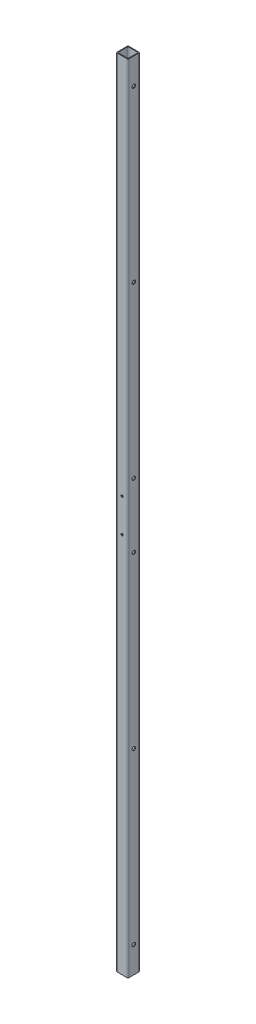
ISO-10303-21;
HEADER;
FILE_DESCRIPTION(('STEP AP214'),'2;1');
FILE_NAME('part.step','',(''),(''),'','','');
FILE_SCHEMA(('AUTOMOTIVE_DESIGN { 1 0 10303 214 1 1 1 1 }'));
ENDSEC;
DATA;
#1=APPLICATION_CONTEXT('core data for automotive mechanical design processes');
#2=APPLICATION_PROTOCOL_DEFINITION('international standard','automotive_design',2000,#1);
#3=PRODUCT_CONTEXT('',#1,'mechanical');
#4=PRODUCT('Part','Part','',(#3));
#5=PRODUCT_RELATED_PRODUCT_CATEGORY('part','',(#4));
#6=PRODUCT_DEFINITION_FORMATION('','',#4);
#7=PRODUCT_DEFINITION_CONTEXT('part definition',#1,'design');
#8=PRODUCT_DEFINITION('design','',#6,#7);
#9=PRODUCT_DEFINITION_SHAPE('','',#8);
#10=(LENGTH_UNIT() NAMED_UNIT(*) SI_UNIT(.MILLI.,.METRE.));
#11=(NAMED_UNIT(*) PLANE_ANGLE_UNIT() SI_UNIT($,.RADIAN.));
#12=(NAMED_UNIT(*) SI_UNIT($,.STERADIAN.) SOLID_ANGLE_UNIT());
#13=UNCERTAINTY_MEASURE_WITH_UNIT(LENGTH_MEASURE(1.E-05),#10,'distance_accuracy_value','');
#14=(GEOMETRIC_REPRESENTATION_CONTEXT(3) GLOBAL_UNCERTAINTY_ASSIGNED_CONTEXT((#13)) GLOBAL_UNIT_ASSIGNED_CONTEXT((#10,
#11,#12)) REPRESENTATION_CONTEXT('',''));
#15=CARTESIAN_POINT('',(0.,0.,0.));
#16=DIRECTION('',(0.,0.,1.));
#17=DIRECTION('',(1.,0.,0.));
#18=AXIS2_PLACEMENT_3D('',#15,#16,#17);
#19=CARTESIAN_POINT('',(0.,1309.624,0.));
#20=DIRECTION('',(0.,-1.,0.));
#21=DIRECTION('',(0.,0.,-1.));
#22=AXIS2_PLACEMENT_3D('',#19,#20,#21);
#23=PLANE('',#22);
#24=DIRECTION('',(0.,0.,1.));
#25=VECTOR('',#24,1.);
#26=CARTESIAN_POINT('',(-9.652,1309.624,9.652));
#27=LINE('',#26,#25);
#28=CARTESIAN_POINT('',(-9.652,1309.624,-8.382));
#29=VERTEX_POINT('',#28);
#30=CARTESIAN_POINT('',(-9.652,1309.624,8.382));
#31=VERTEX_POINT('',#30);
#32=EDGE_CURVE('E181',#29,#31,#27,.T.);
#33=ORIENTED_EDGE('',*,*,#32,.T.);
#34=CARTESIAN_POINT('',(-8.382,1309.624,8.382));
#35=DIRECTION('',(0.,-1.,0.));
#36=DIRECTION('',(0.,0.,-1.));
#37=AXIS2_PLACEMENT_3D('',#34,#35,#36);
#38=CIRCLE('',#37,1.27);
#39=CARTESIAN_POINT('',(-8.382,1309.624,9.652));
#40=VERTEX_POINT('',#39);
#41=EDGE_CURVE('E223',#31,#40,#38,.F.);
#42=ORIENTED_EDGE('',*,*,#41,.T.);
#43=DIRECTION('',(1.,0.,0.));
#44=VECTOR('',#43,1.);
#45=CARTESIAN_POINT('',(-9.652,1309.624,9.652));
#46=LINE('',#45,#44);
#47=CARTESIAN_POINT('',(8.382,1309.624,9.652));
#48=VERTEX_POINT('',#47);
#49=EDGE_CURVE('E176',#40,#48,#46,.T.);
#50=ORIENTED_EDGE('',*,*,#49,.T.);
#51=CARTESIAN_POINT('',(8.382,1309.624,8.382));
#52=DIRECTION('',(0.,-1.,0.));
#53=DIRECTION('',(0.,0.,-1.));
#54=AXIS2_PLACEMENT_3D('',#51,#52,#53);
#55=CIRCLE('',#54,1.27);
#56=CARTESIAN_POINT('',(9.652,1309.624,8.382));
#57=VERTEX_POINT('',#56);
#58=EDGE_CURVE('E218',#48,#57,#55,.F.);
#59=ORIENTED_EDGE('',*,*,#58,.T.);
#60=DIRECTION('',(0.,0.,-1.));
#61=VECTOR('',#60,1.);
#62=CARTESIAN_POINT('',(9.652,1309.624,9.652));
#63=LINE('',#62,#61);
#64=CARTESIAN_POINT('',(9.652,1309.624,-8.382));
#65=VERTEX_POINT('',#64);
#66=EDGE_CURVE('E350',#57,#65,#63,.T.);
#67=ORIENTED_EDGE('',*,*,#66,.T.);
#68=CARTESIAN_POINT('',(8.382,1309.624,-8.382));
#69=DIRECTION('',(0.,-1.,0.));
#70=DIRECTION('',(0.,0.,-1.));
#71=AXIS2_PLACEMENT_3D('',#68,#69,#70);
#72=CIRCLE('',#71,1.27);
#73=CARTESIAN_POINT('',(8.382,1309.624,-9.652));
#74=VERTEX_POINT('',#73);
#75=EDGE_CURVE('E59',#65,#74,#72,.F.);
#76=ORIENTED_EDGE('',*,*,#75,.T.);
#77=DIRECTION('',(-1.,0.,0.));
#78=VECTOR('',#77,1.);
#79=CARTESIAN_POINT('',(-9.652,1309.624,-9.652));
#80=LINE('',#79,#78);
#81=CARTESIAN_POINT('',(-8.382,1309.624,-9.652));
#82=VERTEX_POINT('',#81);
#83=EDGE_CURVE('E352',#74,#82,#80,.T.);
#84=ORIENTED_EDGE('',*,*,#83,.T.);
#85=CARTESIAN_POINT('',(-8.382,1309.624,-8.382));
#86=DIRECTION('',(0.,-1.,0.));
#87=DIRECTION('',(0.,0.,-1.));
#88=AXIS2_PLACEMENT_3D('',#85,#86,#87);
#89=CIRCLE('',#88,1.27);
#90=EDGE_CURVE('E221',#82,#29,#89,.F.);
#91=ORIENTED_EDGE('',*,*,#90,.T.);
#92=EDGE_LOOP('',(#33,#42,#50,#59,#67,#76,#84,#91));
#93=FACE_BOUND('',#92,.T.);
#94=DIRECTION('',(1.,0.,0.));
#95=VECTOR('',#94,1.);
#96=CARTESIAN_POINT('',(-8.382,1309.624,8.382));
#97=LINE('',#96,#95);
#98=CARTESIAN_POINT('',(-7.112,1309.624,8.382));
#99=VERTEX_POINT('',#98);
#100=CARTESIAN_POINT('',(7.112,1309.624,8.382));
#101=VERTEX_POINT('',#100);
#102=EDGE_CURVE('E333',#99,#101,#97,.T.);
#103=ORIENTED_EDGE('',*,*,#102,.F.);
#104=CARTESIAN_POINT('',(-7.112,1309.624,7.112));
#105=DIRECTION('',(0.,-1.,0.));
#106=DIRECTION('',(0.,0.,-1.));
#107=AXIS2_PLACEMENT_3D('',#104,#105,#106);
#108=CIRCLE('',#107,1.27);
#109=CARTESIAN_POINT('',(-8.382,1309.624,7.112));
#110=VERTEX_POINT('',#109);
#111=EDGE_CURVE('E11',#99,#110,#108,.T.);
#112=ORIENTED_EDGE('',*,*,#111,.T.);
#113=DIRECTION('',(0.,0.,1.));
#114=VECTOR('',#113,1.);
#115=CARTESIAN_POINT('',(-8.382,1309.624,8.382));
#116=LINE('',#115,#114);
#117=CARTESIAN_POINT('',(-8.382,1309.624,-7.11199999999999));
#118=VERTEX_POINT('',#117);
#119=EDGE_CURVE('E341',#118,#110,#116,.T.);
#120=ORIENTED_EDGE('',*,*,#119,.F.);
#121=CARTESIAN_POINT('',(-7.112,1309.624,-7.112));
#122=DIRECTION('',(0.,-1.,0.));
#123=DIRECTION('',(0.,0.,-1.));
#124=AXIS2_PLACEMENT_3D('',#121,#122,#123);
#125=CIRCLE('',#124,1.27);
#126=CARTESIAN_POINT('',(-7.112,1309.624,-8.382));
#127=VERTEX_POINT('',#126);
#128=EDGE_CURVE('E236',#118,#127,#125,.T.);
#129=ORIENTED_EDGE('',*,*,#128,.T.);
#130=DIRECTION('',(-1.,0.,0.));
#131=VECTOR('',#130,1.);
#132=CARTESIAN_POINT('',(-8.382,1309.624,-8.382));
#133=LINE('',#132,#131);
#134=CARTESIAN_POINT('',(7.112,1309.624,-8.382));
#135=VERTEX_POINT('',#134);
#136=EDGE_CURVE('E339',#135,#127,#133,.T.);
#137=ORIENTED_EDGE('',*,*,#136,.F.);
#138=CARTESIAN_POINT('',(7.112,1309.624,-7.112));
#139=DIRECTION('',(0.,-1.,0.));
#140=DIRECTION('',(0.,0.,-1.));
#141=AXIS2_PLACEMENT_3D('',#138,#139,#140);
#142=CIRCLE('',#141,1.27);
#143=CARTESIAN_POINT('',(8.382,1309.624,-7.11199999999999));
#144=VERTEX_POINT('',#143);
#145=EDGE_CURVE('E161',#135,#144,#142,.T.);
#146=ORIENTED_EDGE('',*,*,#145,.T.);
#147=DIRECTION('',(0.,0.,-1.));
#148=VECTOR('',#147,1.);
#149=CARTESIAN_POINT('',(8.382,1309.624,8.382));
#150=LINE('',#149,#148);
#151=CARTESIAN_POINT('',(8.382,1309.624,7.112));
#152=VERTEX_POINT('',#151);
#153=EDGE_CURVE('E336',#152,#144,#150,.T.);
#154=ORIENTED_EDGE('',*,*,#153,.F.);
#155=CARTESIAN_POINT('',(7.112,1309.624,7.112));
#156=DIRECTION('',(0.,-1.,0.));
#157=DIRECTION('',(0.,0.,-1.));
#158=AXIS2_PLACEMENT_3D('',#155,#156,#157);
#159=CIRCLE('',#158,1.27);
#160=EDGE_CURVE('E162',#152,#101,#159,.T.);
#161=ORIENTED_EDGE('',*,*,#160,.T.);
#162=EDGE_LOOP('',(#103,#112,#120,#129,#137,#146,#154,#161));
#163=FACE_BOUND('',#162,.T.);
#164=ADVANCED_FACE('F35',(#93,#163),#23,.F.);
#165=CARTESIAN_POINT('',(0.,0.,0.));
#166=DIRECTION('',(0.,-1.,0.));
#167=DIRECTION('',(0.,0.,-1.));
#168=AXIS2_PLACEMENT_3D('',#165,#166,#167);
#169=PLANE('',#168);
#170=DIRECTION('',(1.,0.,0.));
#171=VECTOR('',#170,1.);
#172=CARTESIAN_POINT('',(-9.652,0.,9.652));
#173=LINE('',#172,#171);
#174=CARTESIAN_POINT('',(-8.382,0.,9.652));
#175=VERTEX_POINT('',#174);
#176=CARTESIAN_POINT('',(8.382,0.,9.652));
#177=VERTEX_POINT('',#176);
#178=EDGE_CURVE('E184',#175,#177,#173,.T.);
#179=ORIENTED_EDGE('',*,*,#178,.F.);
#180=CARTESIAN_POINT('',(-8.382,0.,8.382));
#181=DIRECTION('',(0.,-1.,0.));
#182=DIRECTION('',(0.,0.,-1.));
#183=AXIS2_PLACEMENT_3D('',#180,#181,#182);
#184=CIRCLE('',#183,1.27);
#185=CARTESIAN_POINT('',(-9.652,0.,8.382));
#186=VERTEX_POINT('',#185);
#187=EDGE_CURVE('E211',#175,#186,#184,.T.);
#188=ORIENTED_EDGE('',*,*,#187,.T.);
#189=DIRECTION('',(0.,0.,1.));
#190=VECTOR('',#189,1.);
#191=CARTESIAN_POINT('',(-9.652,0.,9.652));
#192=LINE('',#191,#190);
#193=CARTESIAN_POINT('',(-9.652,0.,-8.382));
#194=VERTEX_POINT('',#193);
#195=EDGE_CURVE('E359',#194,#186,#192,.T.);
#196=ORIENTED_EDGE('',*,*,#195,.F.);
#197=CARTESIAN_POINT('',(-8.382,0.,-8.382));
#198=DIRECTION('',(0.,-1.,0.));
#199=DIRECTION('',(0.,0.,-1.));
#200=AXIS2_PLACEMENT_3D('',#197,#198,#199);
#201=CIRCLE('',#200,1.27);
#202=CARTESIAN_POINT('',(-8.382,0.,-9.652));
#203=VERTEX_POINT('',#202);
#204=EDGE_CURVE('E209',#194,#203,#201,.T.);
#205=ORIENTED_EDGE('',*,*,#204,.T.);
#206=DIRECTION('',(-1.,0.,0.));
#207=VECTOR('',#206,1.);
#208=CARTESIAN_POINT('',(-9.652,0.,-9.652));
#209=LINE('',#208,#207);
#210=CARTESIAN_POINT('',(8.382,0.,-9.652));
#211=VERTEX_POINT('',#210);
#212=EDGE_CURVE('E358',#211,#203,#209,.T.);
#213=ORIENTED_EDGE('',*,*,#212,.F.);
#214=CARTESIAN_POINT('',(8.382,0.,-8.382));
#215=DIRECTION('',(0.,-1.,0.));
#216=DIRECTION('',(0.,0.,-1.));
#217=AXIS2_PLACEMENT_3D('',#214,#215,#216);
#218=CIRCLE('',#217,1.27);
#219=CARTESIAN_POINT('',(9.652,0.,-8.382));
#220=VERTEX_POINT('',#219);
#221=EDGE_CURVE('E207',#211,#220,#218,.T.);
#222=ORIENTED_EDGE('',*,*,#221,.T.);
#223=DIRECTION('',(0.,0.,-1.));
#224=VECTOR('',#223,1.);
#225=CARTESIAN_POINT('',(9.652,0.,9.652));
#226=LINE('',#225,#224);
#227=CARTESIAN_POINT('',(9.652,0.,8.382));
#228=VERTEX_POINT('',#227);
#229=EDGE_CURVE('E344',#228,#220,#226,.T.);
#230=ORIENTED_EDGE('',*,*,#229,.F.);
#231=CARTESIAN_POINT('',(8.382,0.,8.382));
#232=DIRECTION('',(0.,-1.,0.));
#233=DIRECTION('',(0.,0.,-1.));
#234=AXIS2_PLACEMENT_3D('',#231,#232,#233);
#235=CIRCLE('',#234,1.27);
#236=EDGE_CURVE('E205',#228,#177,#235,.T.);
#237=ORIENTED_EDGE('',*,*,#236,.T.);
#238=EDGE_LOOP('',(#179,#188,#196,#205,#213,#222,#230,#237));
#239=FACE_BOUND('',#238,.T.);
#240=DIRECTION('',(-1.,0.,0.));
#241=VECTOR('',#240,1.);
#242=CARTESIAN_POINT('',(-8.382,0.,-8.382));
#243=LINE('',#242,#241);
#244=CARTESIAN_POINT('',(7.112,0.,-8.382));
#245=VERTEX_POINT('',#244);
#246=CARTESIAN_POINT('',(-7.112,0.,-8.382));
#247=VERTEX_POINT('',#246);
#248=EDGE_CURVE('E154',#245,#247,#243,.T.);
#249=ORIENTED_EDGE('',*,*,#248,.T.);
#250=CARTESIAN_POINT('',(-7.112,0.,-7.112));
#251=DIRECTION('',(0.,-1.,0.));
#252=DIRECTION('',(0.,0.,-1.));
#253=AXIS2_PLACEMENT_3D('',#250,#251,#252);
#254=CIRCLE('',#253,1.27);
#255=CARTESIAN_POINT('',(-8.382,0.,-7.11199999999999));
#256=VERTEX_POINT('',#255);
#257=EDGE_CURVE('E234',#247,#256,#254,.F.);
#258=ORIENTED_EDGE('',*,*,#257,.T.);
#259=DIRECTION('',(0.,0.,1.));
#260=VECTOR('',#259,1.);
#261=CARTESIAN_POINT('',(-8.382,0.,8.382));
#262=LINE('',#261,#260);
#263=CARTESIAN_POINT('',(-8.382,0.,7.112));
#264=VERTEX_POINT('',#263);
#265=EDGE_CURVE('E172',#256,#264,#262,.T.);
#266=ORIENTED_EDGE('',*,*,#265,.T.);
#267=CARTESIAN_POINT('',(-7.112,0.,7.112));
#268=DIRECTION('',(0.,-1.,0.));
#269=DIRECTION('',(0.,0.,-1.));
#270=AXIS2_PLACEMENT_3D('',#267,#268,#269);
#271=CIRCLE('',#270,1.27);
#272=CARTESIAN_POINT('',(-7.112,0.,8.382));
#273=VERTEX_POINT('',#272);
#274=EDGE_CURVE('E44',#264,#273,#271,.F.);
#275=ORIENTED_EDGE('',*,*,#274,.T.);
#276=DIRECTION('',(1.,0.,0.));
#277=VECTOR('',#276,1.);
#278=CARTESIAN_POINT('',(-8.382,0.,8.382));
#279=LINE('',#278,#277);
#280=CARTESIAN_POINT('',(7.112,0.,8.382));
#281=VERTEX_POINT('',#280);
#282=EDGE_CURVE('E332',#273,#281,#279,.T.);
#283=ORIENTED_EDGE('',*,*,#282,.T.);
#284=CARTESIAN_POINT('',(7.112,0.,7.112));
#285=DIRECTION('',(0.,-1.,0.));
#286=DIRECTION('',(0.,0.,-1.));
#287=AXIS2_PLACEMENT_3D('',#284,#285,#286);
#288=CIRCLE('',#287,1.27);
#289=CARTESIAN_POINT('',(8.382,0.,7.112));
#290=VERTEX_POINT('',#289);
#291=EDGE_CURVE('E238',#281,#290,#288,.F.);
#292=ORIENTED_EDGE('',*,*,#291,.T.);
#293=DIRECTION('',(0.,0.,-1.));
#294=VECTOR('',#293,1.);
#295=CARTESIAN_POINT('',(8.382,0.,8.382));
#296=LINE('',#295,#294);
#297=CARTESIAN_POINT('',(8.382,0.,-7.11199999999999));
#298=VERTEX_POINT('',#297);
#299=EDGE_CURVE('E156',#290,#298,#296,.T.);
#300=ORIENTED_EDGE('',*,*,#299,.T.);
#301=CARTESIAN_POINT('',(7.112,0.,-7.112));
#302=DIRECTION('',(0.,-1.,0.));
#303=DIRECTION('',(0.,0.,-1.));
#304=AXIS2_PLACEMENT_3D('',#301,#302,#303);
#305=CIRCLE('',#304,1.27);
#306=EDGE_CURVE('E151',#298,#245,#305,.F.);
#307=ORIENTED_EDGE('',*,*,#306,.T.);
#308=EDGE_LOOP('',(#249,#258,#266,#275,#283,#292,#300,#307));
#309=FACE_BOUND('',#308,.T.);
#310=ADVANCED_FACE('F153',(#239,#309),#169,.T.);
#311=CARTESIAN_POINT('',(9.652,1309.624,9.652));
#312=DIRECTION('',(-1.,0.,0.));
#313=DIRECTION('',(0.,0.,1.));
#314=AXIS2_PLACEMENT_3D('',#311,#312,#313);
#315=PLANE('',#314);
#316=CARTESIAN_POINT('',(9.652,1266.444,0.));
#317=DIRECTION('',(1.,0.,0.));
#318=DIRECTION('',(0.,0.,-1.));
#319=AXIS2_PLACEMENT_3D('',#316,#317,#318);
#320=CIRCLE('',#319,2.8956);
#321=CARTESIAN_POINT('',(9.652,1266.444,-2.89559999999992));
#322=VERTEX_POINT('',#321);
#323=EDGE_CURVE('E274',#322,#322,#320,.T.);
#324=ORIENTED_EDGE('',*,*,#323,.F.);
#325=EDGE_LOOP('',(#324));
#326=FACE_BOUND('',#325,.T.);
#327=CARTESIAN_POINT('',(9.652,987.044,0.));
#328=DIRECTION('',(1.,0.,0.));
#329=DIRECTION('',(0.,0.,-1.));
#330=AXIS2_PLACEMENT_3D('',#327,#328,#329);
#331=CIRCLE('',#330,2.8956);
#332=CARTESIAN_POINT('',(9.652,987.044,-2.89559999999992));
#333=VERTEX_POINT('',#332);
#334=EDGE_CURVE('E292',#333,#333,#331,.T.);
#335=ORIENTED_EDGE('',*,*,#334,.F.);
#336=EDGE_LOOP('',(#335));
#337=FACE_BOUND('',#336,.T.);
#338=CARTESIAN_POINT('',(9.652,707.644,0.));
#339=DIRECTION('',(1.,0.,0.));
#340=DIRECTION('',(0.,0.,-1.));
#341=AXIS2_PLACEMENT_3D('',#338,#339,#340);
#342=CIRCLE('',#341,2.8956);
#343=CARTESIAN_POINT('',(9.652,707.644,-2.89559999999992));
#344=VERTEX_POINT('',#343);
#345=EDGE_CURVE('E299',#344,#344,#342,.T.);
#346=ORIENTED_EDGE('',*,*,#345,.F.);
#347=EDGE_LOOP('',(#346));
#348=FACE_BOUND('',#347,.T.);
#349=CARTESIAN_POINT('',(9.652,43.18,-1.54390389361936E-13));
#350=DIRECTION('',(1.,0.,0.));
#351=DIRECTION('',(0.,0.,-1.));
#352=AXIS2_PLACEMENT_3D('',#349,#350,#351);
#353=CIRCLE('',#352,2.89559999999998);
#354=CARTESIAN_POINT('',(9.652,43.18,-2.89560000000014));
#355=VERTEX_POINT('',#354);
#356=EDGE_CURVE('E306',#355,#355,#353,.T.);
#357=ORIENTED_EDGE('',*,*,#356,.F.);
#358=EDGE_LOOP('',(#357));
#359=FACE_BOUND('',#358,.T.);
#360=CARTESIAN_POINT('',(9.652,322.58,-1.54390389361936E-13));
#361=DIRECTION('',(1.,0.,0.));
#362=DIRECTION('',(0.,0.,-1.));
#363=AXIS2_PLACEMENT_3D('',#360,#361,#362);
#364=CIRCLE('',#363,2.8956);
#365=CARTESIAN_POINT('',(9.652,322.58,-2.89560000000015));
#366=VERTEX_POINT('',#365);
#367=EDGE_CURVE('E313',#366,#366,#364,.T.);
#368=ORIENTED_EDGE('',*,*,#367,.F.);
#369=EDGE_LOOP('',(#368));
#370=FACE_BOUND('',#369,.T.);
#371=CARTESIAN_POINT('',(9.652,601.98,-1.54390389361936E-13));
#372=DIRECTION('',(1.,0.,0.));
#373=DIRECTION('',(0.,0.,-1.));
#374=AXIS2_PLACEMENT_3D('',#371,#372,#373);
#375=CIRCLE('',#374,2.8956);
#376=CARTESIAN_POINT('',(9.652,601.98,-2.89560000000015));
#377=VERTEX_POINT('',#376);
#378=EDGE_CURVE('E320',#377,#377,#375,.T.);
#379=ORIENTED_EDGE('',*,*,#378,.F.);
#380=EDGE_LOOP('',(#379));
#381=FACE_BOUND('',#380,.T.);
#382=ORIENTED_EDGE('',*,*,#229,.T.);
#383=DIRECTION('',(0.,-1.,0.));
#384=VECTOR('',#383,1.);
#385=CARTESIAN_POINT('',(9.652,1309.624,-8.382));
#386=LINE('',#385,#384);
#387=EDGE_CURVE('E232',#220,#65,#386,.F.);
#388=ORIENTED_EDGE('',*,*,#387,.T.);
#389=ORIENTED_EDGE('',*,*,#66,.F.);
#390=DIRECTION('',(0.,-1.,0.));
#391=VECTOR('',#390,1.);
#392=CARTESIAN_POINT('',(9.652,1309.624,8.382));
#393=LINE('',#392,#391);
#394=EDGE_CURVE('E229',#57,#228,#393,.T.);
#395=ORIENTED_EDGE('',*,*,#394,.T.);
#396=EDGE_LOOP('',(#382,#388,#389,#395));
#397=FACE_BOUND('',#396,.T.);
#398=ADVANCED_FACE('F378',(#326,#337,#348,#359,#370,#381,#397),#315,.F.);
#399=CARTESIAN_POINT('',(-9.652,1309.624,-9.652));
#400=DIRECTION('',(0.,0.,1.));
#401=DIRECTION('',(1.,0.,0.));
#402=AXIS2_PLACEMENT_3D('',#399,#400,#401);
#403=PLANE('',#402);
#404=CARTESIAN_POINT('',(0.,682.244,-9.652));
#405=DIRECTION('',(0.,0.,-1.));
#406=DIRECTION('',(-1.,0.,0.));
#407=AXIS2_PLACEMENT_3D('',#404,#405,#406);
#408=CIRCLE('',#407,1.72719999999999);
#409=CARTESIAN_POINT('',(-1.72719999999999,682.244,-9.652));
#410=VERTEX_POINT('',#409);
#411=EDGE_CURVE('E817',#410,#410,#408,.T.);
#412=ORIENTED_EDGE('',*,*,#411,.F.);
#413=EDGE_LOOP('',(#412));
#414=FACE_BOUND('',#413,.T.);
#415=CARTESIAN_POINT('',(0.,627.38,-9.652));
#416=DIRECTION('',(0.,0.,-1.));
#417=DIRECTION('',(-1.,0.,0.));
#418=AXIS2_PLACEMENT_3D('',#415,#416,#417);
#419=CIRCLE('',#418,1.72719999999999);
#420=CARTESIAN_POINT('',(-1.72719999999999,627.38,-9.652));
#421=VERTEX_POINT('',#420);
#422=EDGE_CURVE('E277',#421,#421,#419,.T.);
#423=ORIENTED_EDGE('',*,*,#422,.F.);
#424=EDGE_LOOP('',(#423));
#425=FACE_BOUND('',#424,.T.);
#426=ORIENTED_EDGE('',*,*,#212,.T.);
#427=DIRECTION('',(0.,-1.,0.));
#428=VECTOR('',#427,1.);
#429=CARTESIAN_POINT('',(-8.382,1309.624,-9.652));
#430=LINE('',#429,#428);
#431=EDGE_CURVE('E52',#203,#82,#430,.F.);
#432=ORIENTED_EDGE('',*,*,#431,.T.);
#433=ORIENTED_EDGE('',*,*,#83,.F.);
#434=DIRECTION('',(0.,-1.,0.));
#435=VECTOR('',#434,1.);
#436=CARTESIAN_POINT('',(8.382,1309.624,-9.652));
#437=LINE('',#436,#435);
#438=EDGE_CURVE('E225',#74,#211,#437,.T.);
#439=ORIENTED_EDGE('',*,*,#438,.T.);
#440=EDGE_LOOP('',(#426,#432,#433,#439));
#441=FACE_BOUND('',#440,.T.);
#442=ADVANCED_FACE('F385',(#414,#425,#441),#403,.F.);
#443=CARTESIAN_POINT('',(-9.652,1309.624,9.652));
#444=DIRECTION('',(1.,0.,0.));
#445=DIRECTION('',(0.,0.,-1.));
#446=AXIS2_PLACEMENT_3D('',#443,#444,#445);
#447=PLANE('',#446);
#448=CARTESIAN_POINT('',(-9.652,1266.444,0.));
#449=DIRECTION('',(1.,0.,0.));
#450=DIRECTION('',(0.,0.,-1.));
#451=AXIS2_PLACEMENT_3D('',#448,#449,#450);
#452=CIRCLE('',#451,2.8956);
#453=CARTESIAN_POINT('',(-9.652,1266.444,-2.89559999999992));
#454=VERTEX_POINT('',#453);
#455=EDGE_CURVE('E266',#454,#454,#452,.T.);
#456=ORIENTED_EDGE('',*,*,#455,.T.);
#457=EDGE_LOOP('',(#456));
#458=FACE_BOUND('',#457,.T.);
#459=CARTESIAN_POINT('',(-9.652,987.044,0.));
#460=DIRECTION('',(1.,0.,0.));
#461=DIRECTION('',(0.,0.,-1.));
#462=AXIS2_PLACEMENT_3D('',#459,#460,#461);
#463=CIRCLE('',#462,2.8956);
#464=CARTESIAN_POINT('',(-9.652,987.044,-2.89559999999992));
#465=VERTEX_POINT('',#464);
#466=EDGE_CURVE('E262',#465,#465,#463,.T.);
#467=ORIENTED_EDGE('',*,*,#466,.T.);
#468=EDGE_LOOP('',(#467));
#469=FACE_BOUND('',#468,.T.);
#470=CARTESIAN_POINT('',(-9.652,707.644,0.));
#471=DIRECTION('',(1.,0.,0.));
#472=DIRECTION('',(0.,0.,-1.));
#473=AXIS2_PLACEMENT_3D('',#470,#471,#472);
#474=CIRCLE('',#473,2.8956);
#475=CARTESIAN_POINT('',(-9.652,707.644,-2.89559999999992));
#476=VERTEX_POINT('',#475);
#477=EDGE_CURVE('E257',#476,#476,#474,.T.);
#478=ORIENTED_EDGE('',*,*,#477,.T.);
#479=EDGE_LOOP('',(#478));
#480=FACE_BOUND('',#479,.T.);
#481=CARTESIAN_POINT('',(-9.652,43.18,-1.54390389361936E-13));
#482=DIRECTION('',(1.,0.,0.));
#483=DIRECTION('',(0.,0.,-1.));
#484=AXIS2_PLACEMENT_3D('',#481,#482,#483);
#485=CIRCLE('',#484,2.89559999999998);
#486=CARTESIAN_POINT('',(-9.652,43.18,-2.89560000000014));
#487=VERTEX_POINT('',#486);
#488=EDGE_CURVE('E252',#487,#487,#485,.T.);
#489=ORIENTED_EDGE('',*,*,#488,.T.);
#490=EDGE_LOOP('',(#489));
#491=FACE_BOUND('',#490,.T.);
#492=CARTESIAN_POINT('',(-9.652,322.58,-1.54390389361936E-13));
#493=DIRECTION('',(1.,0.,0.));
#494=DIRECTION('',(0.,0.,-1.));
#495=AXIS2_PLACEMENT_3D('',#492,#493,#494);
#496=CIRCLE('',#495,2.8956);
#497=CARTESIAN_POINT('',(-9.652,322.58,-2.89560000000015));
#498=VERTEX_POINT('',#497);
#499=EDGE_CURVE('E247',#498,#498,#496,.T.);
#500=ORIENTED_EDGE('',*,*,#499,.T.);
#501=EDGE_LOOP('',(#500));
#502=FACE_BOUND('',#501,.T.);
#503=CARTESIAN_POINT('',(-9.652,601.98,-1.54390389361936E-13));
#504=DIRECTION('',(1.,0.,0.));
#505=DIRECTION('',(0.,0.,-1.));
#506=AXIS2_PLACEMENT_3D('',#503,#504,#505);
#507=CIRCLE('',#506,2.8956);
#508=CARTESIAN_POINT('',(-9.652,601.98,-2.89560000000015));
#509=VERTEX_POINT('',#508);
#510=EDGE_CURVE('E323',#509,#509,#507,.T.);
#511=ORIENTED_EDGE('',*,*,#510,.T.);
#512=EDGE_LOOP('',(#511));
#513=FACE_BOUND('',#512,.T.);
#514=ORIENTED_EDGE('',*,*,#195,.T.);
#515=DIRECTION('',(0.,-1.,0.));
#516=VECTOR('',#515,1.);
#517=CARTESIAN_POINT('',(-9.652,1309.624,8.382));
#518=LINE('',#517,#516);
#519=EDGE_CURVE('E216',#186,#31,#518,.F.);
#520=ORIENTED_EDGE('',*,*,#519,.T.);
#521=ORIENTED_EDGE('',*,*,#32,.F.);
#522=DIRECTION('',(0.,-1.,0.));
#523=VECTOR('',#522,1.);
#524=CARTESIAN_POINT('',(-9.652,1309.624,-8.382));
#525=LINE('',#524,#523);
#526=EDGE_CURVE('E213',#29,#194,#525,.T.);
#527=ORIENTED_EDGE('',*,*,#526,.T.);
#528=EDGE_LOOP('',(#514,#520,#521,#527));
#529=FACE_BOUND('',#528,.T.);
#530=ADVANCED_FACE('F391',(#458,#469,#480,#491,#502,#513,#529),#447,.F.);
#531=CARTESIAN_POINT('',(-9.652,1309.624,9.652));
#532=DIRECTION('',(0.,0.,-1.));
#533=DIRECTION('',(-1.,0.,0.));
#534=AXIS2_PLACEMENT_3D('',#531,#532,#533);
#535=PLANE('',#534);
#536=CARTESIAN_POINT('',(0.,682.244,9.652));
#537=DIRECTION('',(0.,0.,-1.));
#538=DIRECTION('',(-1.,0.,0.));
#539=AXIS2_PLACEMENT_3D('',#536,#537,#538);
#540=CIRCLE('',#539,1.72719999999999);
#541=CARTESIAN_POINT('',(-1.72719999999999,682.244,9.652));
#542=VERTEX_POINT('',#541);
#543=EDGE_CURVE('E813',#542,#542,#540,.T.);
#544=ORIENTED_EDGE('',*,*,#543,.T.);
#545=EDGE_LOOP('',(#544));
#546=FACE_BOUND('',#545,.T.);
#547=CARTESIAN_POINT('',(0.,627.38,9.652));
#548=DIRECTION('',(0.,0.,-1.));
#549=DIRECTION('',(-1.,0.,0.));
#550=AXIS2_PLACEMENT_3D('',#547,#548,#549);
#551=CIRCLE('',#550,1.72719999999999);
#552=CARTESIAN_POINT('',(-1.72719999999999,627.38,9.652));
#553=VERTEX_POINT('',#552);
#554=EDGE_CURVE('E270',#553,#553,#551,.T.);
#555=ORIENTED_EDGE('',*,*,#554,.T.);
#556=EDGE_LOOP('',(#555));
#557=FACE_BOUND('',#556,.T.);
#558=ORIENTED_EDGE('',*,*,#49,.F.);
#559=DIRECTION('',(0.,-1.,0.));
#560=VECTOR('',#559,1.);
#561=CARTESIAN_POINT('',(-8.382,1309.624,9.652));
#562=LINE('',#561,#560);
#563=EDGE_CURVE('E202',#40,#175,#562,.T.);
#564=ORIENTED_EDGE('',*,*,#563,.T.);
#565=ORIENTED_EDGE('',*,*,#178,.T.);
#566=DIRECTION('',(0.,-1.,0.));
#567=VECTOR('',#566,1.);
#568=CARTESIAN_POINT('',(8.382,1309.624,9.652));
#569=LINE('',#568,#567);
#570=EDGE_CURVE('E200',#177,#48,#569,.F.);
#571=ORIENTED_EDGE('',*,*,#570,.T.);
#572=EDGE_LOOP('',(#558,#564,#565,#571));
#573=FACE_BOUND('',#572,.T.);
#574=ADVANCED_FACE('F369',(#546,#557,#573),#535,.F.);
#575=CARTESIAN_POINT('',(-8.382,1309.624,8.382));
#576=DIRECTION('',(0.,0.,-1.));
#577=DIRECTION('',(-1.,0.,0.));
#578=AXIS2_PLACEMENT_3D('',#575,#576,#577);
#579=PLANE('',#578);
#580=CARTESIAN_POINT('',(0.,682.244,8.382));
#581=DIRECTION('',(0.,0.,-1.));
#582=DIRECTION('',(-1.,0.,0.));
#583=AXIS2_PLACEMENT_3D('',#580,#581,#582);
#584=CIRCLE('',#583,1.72719999999999);
#585=CARTESIAN_POINT('',(-1.72719999999999,682.244,8.382));
#586=VERTEX_POINT('',#585);
#587=EDGE_CURVE('E282',#586,#586,#584,.T.);
#588=ORIENTED_EDGE('',*,*,#587,.F.);
#589=EDGE_LOOP('',(#588));
#590=FACE_BOUND('',#589,.T.);
#591=CARTESIAN_POINT('',(0.,627.38,8.382));
#592=DIRECTION('',(0.,0.,-1.));
#593=DIRECTION('',(-1.,0.,0.));
#594=AXIS2_PLACEMENT_3D('',#591,#592,#593);
#595=CIRCLE('',#594,1.72719999999999);
#596=CARTESIAN_POINT('',(-1.72719999999999,627.38,8.382));
#597=VERTEX_POINT('',#596);
#598=EDGE_CURVE('E269',#597,#597,#595,.T.);
#599=ORIENTED_EDGE('',*,*,#598,.F.);
#600=EDGE_LOOP('',(#599));
#601=FACE_BOUND('',#600,.T.);
#602=ORIENTED_EDGE('',*,*,#102,.T.);
#603=DIRECTION('',(0.,-1.,0.));
#604=VECTOR('',#603,1.);
#605=CARTESIAN_POINT('',(7.112,0.,8.382));
#606=LINE('',#605,#604);
#607=EDGE_CURVE('E193',#101,#281,#606,.T.);
#608=ORIENTED_EDGE('',*,*,#607,.T.);
#609=ORIENTED_EDGE('',*,*,#282,.F.);
#610=DIRECTION('',(0.,-1.,0.));
#611=VECTOR('',#610,1.);
#612=CARTESIAN_POINT('',(-7.112,1309.624,8.382));
#613=LINE('',#612,#611);
#614=EDGE_CURVE('E191',#273,#99,#613,.F.);
#615=ORIENTED_EDGE('',*,*,#614,.T.);
#616=EDGE_LOOP('',(#602,#608,#609,#615));
#617=FACE_BOUND('',#616,.T.);
#618=ADVANCED_FACE('F412',(#590,#601,#617),#579,.T.);
#619=CARTESIAN_POINT('',(8.382,1309.624,8.382));
#620=DIRECTION('',(-1.,0.,0.));
#621=DIRECTION('',(0.,0.,1.));
#622=AXIS2_PLACEMENT_3D('',#619,#620,#621);
#623=PLANE('',#622);
#624=CARTESIAN_POINT('',(8.382,1266.444,0.));
#625=DIRECTION('',(-1.,0.,0.));
#626=DIRECTION('',(0.,0.,1.));
#627=AXIS2_PLACEMENT_3D('',#624,#625,#626);
#628=CIRCLE('',#627,2.8956);
#629=CARTESIAN_POINT('',(8.382,1266.444,2.89560000000007));
#630=VERTEX_POINT('',#629);
#631=EDGE_CURVE('E265',#630,#630,#628,.T.);
#632=ORIENTED_EDGE('',*,*,#631,.F.);
#633=EDGE_LOOP('',(#632));
#634=FACE_BOUND('',#633,.T.);
#635=CARTESIAN_POINT('',(8.382,987.044,0.));
#636=DIRECTION('',(-1.,0.,0.));
#637=DIRECTION('',(0.,0.,1.));
#638=AXIS2_PLACEMENT_3D('',#635,#636,#637);
#639=CIRCLE('',#638,2.8956);
#640=CARTESIAN_POINT('',(8.382,987.044,2.89560000000007));
#641=VERTEX_POINT('',#640);
#642=EDGE_CURVE('E261',#641,#641,#639,.T.);
#643=ORIENTED_EDGE('',*,*,#642,.F.);
#644=EDGE_LOOP('',(#643));
#645=FACE_BOUND('',#644,.T.);
#646=CARTESIAN_POINT('',(8.382,707.644,0.));
#647=DIRECTION('',(-1.,0.,0.));
#648=DIRECTION('',(0.,0.,1.));
#649=AXIS2_PLACEMENT_3D('',#646,#647,#648);
#650=CIRCLE('',#649,2.8956);
#651=CARTESIAN_POINT('',(8.382,707.644,2.89560000000007));
#652=VERTEX_POINT('',#651);
#653=EDGE_CURVE('E256',#652,#652,#650,.T.);
#654=ORIENTED_EDGE('',*,*,#653,.F.);
#655=EDGE_LOOP('',(#654));
#656=FACE_BOUND('',#655,.T.);
#657=CARTESIAN_POINT('',(8.382,43.18,-1.54390389361936E-13));
#658=DIRECTION('',(-1.,0.,0.));
#659=DIRECTION('',(0.,0.,1.));
#660=AXIS2_PLACEMENT_3D('',#657,#658,#659);
#661=CIRCLE('',#660,2.89559999999998);
#662=CARTESIAN_POINT('',(8.382,43.18,2.89559999999983));
#663=VERTEX_POINT('',#662);
#664=EDGE_CURVE('E251',#663,#663,#661,.T.);
#665=ORIENTED_EDGE('',*,*,#664,.F.);
#666=EDGE_LOOP('',(#665));
#667=FACE_BOUND('',#666,.T.);
#668=CARTESIAN_POINT('',(8.382,322.58,-1.54390389361936E-13));
#669=DIRECTION('',(-1.,0.,0.));
#670=DIRECTION('',(0.,0.,1.));
#671=AXIS2_PLACEMENT_3D('',#668,#669,#670);
#672=CIRCLE('',#671,2.8956);
#673=CARTESIAN_POINT('',(8.382,322.58,2.89559999999984));
#674=VERTEX_POINT('',#673);
#675=EDGE_CURVE('E246',#674,#674,#672,.T.);
#676=ORIENTED_EDGE('',*,*,#675,.F.);
#677=EDGE_LOOP('',(#676));
#678=FACE_BOUND('',#677,.T.);
#679=CARTESIAN_POINT('',(8.382,601.98,-1.54390389361936E-13));
#680=DIRECTION('',(-1.,0.,0.));
#681=DIRECTION('',(0.,0.,1.));
#682=AXIS2_PLACEMENT_3D('',#679,#680,#681);
#683=CIRCLE('',#682,2.8956);
#684=CARTESIAN_POINT('',(8.382,601.98,2.89559999999984));
#685=VERTEX_POINT('',#684);
#686=EDGE_CURVE('E329',#685,#685,#683,.T.);
#687=ORIENTED_EDGE('',*,*,#686,.F.);
#688=EDGE_LOOP('',(#687));
#689=FACE_BOUND('',#688,.T.);
#690=ORIENTED_EDGE('',*,*,#299,.F.);
#691=DIRECTION('',(0.,-1.,0.));
#692=VECTOR('',#691,1.);
#693=CARTESIAN_POINT('',(8.382,1309.624,7.112));
#694=LINE('',#693,#692);
#695=EDGE_CURVE('E198',#290,#152,#694,.F.);
#696=ORIENTED_EDGE('',*,*,#695,.T.);
#697=ORIENTED_EDGE('',*,*,#153,.T.);
#698=DIRECTION('',(0.,-1.,0.));
#699=VECTOR('',#698,1.);
#700=CARTESIAN_POINT('',(8.382,0.,-7.112));
#701=LINE('',#700,#699);
#702=EDGE_CURVE('E196',#144,#298,#701,.T.);
#703=ORIENTED_EDGE('',*,*,#702,.T.);
#704=EDGE_LOOP('',(#690,#696,#697,#703));
#705=FACE_BOUND('',#704,.T.);
#706=ADVANCED_FACE('F563',(#634,#645,#656,#667,#678,#689,#705),#623,.T.);
#707=CARTESIAN_POINT('',(-8.382,1309.624,-8.382));
#708=DIRECTION('',(0.,0.,1.));
#709=DIRECTION('',(1.,0.,0.));
#710=AXIS2_PLACEMENT_3D('',#707,#708,#709);
#711=PLANE('',#710);
#712=CARTESIAN_POINT('',(0.,682.244,-8.382));
#713=DIRECTION('',(0.,0.,1.));
#714=DIRECTION('',(1.,0.,0.));
#715=AXIS2_PLACEMENT_3D('',#712,#713,#714);
#716=CIRCLE('',#715,1.72719999999999);
#717=CARTESIAN_POINT('',(1.72719999999999,682.244,-8.382));
#718=VERTEX_POINT('',#717);
#719=EDGE_CURVE('E39',#718,#718,#716,.T.);
#720=ORIENTED_EDGE('',*,*,#719,.F.);
#721=EDGE_LOOP('',(#720));
#722=FACE_BOUND('',#721,.T.);
#723=CARTESIAN_POINT('',(0.,627.38,-8.382));
#724=DIRECTION('',(0.,0.,1.));
#725=DIRECTION('',(1.,0.,0.));
#726=AXIS2_PLACEMENT_3D('',#723,#724,#725);
#727=CIRCLE('',#726,1.72719999999999);
#728=CARTESIAN_POINT('',(1.72719999999998,627.38,-8.382));
#729=VERTEX_POINT('',#728);
#730=EDGE_CURVE('E267',#729,#729,#727,.T.);
#731=ORIENTED_EDGE('',*,*,#730,.F.);
#732=EDGE_LOOP('',(#731));
#733=FACE_BOUND('',#732,.T.);
#734=ORIENTED_EDGE('',*,*,#136,.T.);
#735=DIRECTION('',(0.,-1.,0.));
#736=VECTOR('',#735,1.);
#737=CARTESIAN_POINT('',(-7.112,0.,-8.382));
#738=LINE('',#737,#736);
#739=EDGE_CURVE('E171',#127,#247,#738,.T.);
#740=ORIENTED_EDGE('',*,*,#739,.T.);
#741=ORIENTED_EDGE('',*,*,#248,.F.);
#742=DIRECTION('',(0.,-1.,0.));
#743=VECTOR('',#742,1.);
#744=CARTESIAN_POINT('',(7.112,1309.624,-8.382));
#745=LINE('',#744,#743);
#746=EDGE_CURVE('E168',#245,#135,#745,.F.);
#747=ORIENTED_EDGE('',*,*,#746,.T.);
#748=EDGE_LOOP('',(#734,#740,#741,#747));
#749=FACE_BOUND('',#748,.T.);
#750=ADVANCED_FACE('F167',(#722,#733,#749),#711,.T.);
#751=CARTESIAN_POINT('',(-8.382,1309.624,8.382));
#752=DIRECTION('',(1.,0.,0.));
#753=DIRECTION('',(0.,0.,-1.));
#754=AXIS2_PLACEMENT_3D('',#751,#752,#753);
#755=PLANE('',#754);
#756=CARTESIAN_POINT('',(-8.382,1266.444,0.));
#757=DIRECTION('',(1.,0.,0.));
#758=DIRECTION('',(0.,0.,-1.));
#759=AXIS2_PLACEMENT_3D('',#756,#757,#758);
#760=CIRCLE('',#759,2.8956);
#761=CARTESIAN_POINT('',(-8.382,1266.444,-2.89559999999992));
#762=VERTEX_POINT('',#761);
#763=EDGE_CURVE('E263',#762,#762,#760,.T.);
#764=ORIENTED_EDGE('',*,*,#763,.F.);
#765=EDGE_LOOP('',(#764));
#766=FACE_BOUND('',#765,.T.);
#767=CARTESIAN_POINT('',(-8.382,987.044,0.));
#768=DIRECTION('',(1.,0.,0.));
#769=DIRECTION('',(0.,0.,-1.));
#770=AXIS2_PLACEMENT_3D('',#767,#768,#769);
#771=CIRCLE('',#770,2.8956);
#772=CARTESIAN_POINT('',(-8.382,987.044,-2.89559999999992));
#773=VERTEX_POINT('',#772);
#774=EDGE_CURVE('E258',#773,#773,#771,.T.);
#775=ORIENTED_EDGE('',*,*,#774,.F.);
#776=EDGE_LOOP('',(#775));
#777=FACE_BOUND('',#776,.T.);
#778=CARTESIAN_POINT('',(-8.382,707.644,0.));
#779=DIRECTION('',(1.,0.,0.));
#780=DIRECTION('',(0.,0.,-1.));
#781=AXIS2_PLACEMENT_3D('',#778,#779,#780);
#782=CIRCLE('',#781,2.8956);
#783=CARTESIAN_POINT('',(-8.382,707.644,-2.89559999999992));
#784=VERTEX_POINT('',#783);
#785=EDGE_CURVE('E253',#784,#784,#782,.T.);
#786=ORIENTED_EDGE('',*,*,#785,.F.);
#787=EDGE_LOOP('',(#786));
#788=FACE_BOUND('',#787,.T.);
#789=CARTESIAN_POINT('',(-8.382,43.18,-1.54390389361936E-13));
#790=DIRECTION('',(1.,0.,0.));
#791=DIRECTION('',(0.,0.,-1.));
#792=AXIS2_PLACEMENT_3D('',#789,#790,#791);
#793=CIRCLE('',#792,2.89559999999998);
#794=CARTESIAN_POINT('',(-8.382,43.18,-2.89560000000014));
#795=VERTEX_POINT('',#794);
#796=EDGE_CURVE('E248',#795,#795,#793,.T.);
#797=ORIENTED_EDGE('',*,*,#796,.F.);
#798=EDGE_LOOP('',(#797));
#799=FACE_BOUND('',#798,.T.);
#800=CARTESIAN_POINT('',(-8.382,322.58,-1.54390389361936E-13));
#801=DIRECTION('',(1.,0.,0.));
#802=DIRECTION('',(0.,0.,-1.));
#803=AXIS2_PLACEMENT_3D('',#800,#801,#802);
#804=CIRCLE('',#803,2.8956);
#805=CARTESIAN_POINT('',(-8.382,322.58,-2.89560000000015));
#806=VERTEX_POINT('',#805);
#807=EDGE_CURVE('E243',#806,#806,#804,.T.);
#808=ORIENTED_EDGE('',*,*,#807,.F.);
#809=EDGE_LOOP('',(#808));
#810=FACE_BOUND('',#809,.T.);
#811=CARTESIAN_POINT('',(-8.382,601.98,-1.54390389361936E-13));
#812=DIRECTION('',(1.,0.,0.));
#813=DIRECTION('',(0.,0.,-1.));
#814=AXIS2_PLACEMENT_3D('',#811,#812,#813);
#815=CIRCLE('',#814,2.8956);
#816=CARTESIAN_POINT('',(-8.382,601.98,-2.89560000000015));
#817=VERTEX_POINT('',#816);
#818=EDGE_CURVE('E326',#817,#817,#815,.T.);
#819=ORIENTED_EDGE('',*,*,#818,.F.);
#820=EDGE_LOOP('',(#819));
#821=FACE_BOUND('',#820,.T.);
#822=ORIENTED_EDGE('',*,*,#265,.F.);
#823=DIRECTION('',(0.,-1.,0.));
#824=VECTOR('',#823,1.);
#825=CARTESIAN_POINT('',(-8.382,1309.624,-7.112));
#826=LINE('',#825,#824);
#827=EDGE_CURVE('E189',#256,#118,#826,.F.);
#828=ORIENTED_EDGE('',*,*,#827,.T.);
#829=ORIENTED_EDGE('',*,*,#119,.T.);
#830=DIRECTION('',(0.,-1.,0.));
#831=VECTOR('',#830,1.);
#832=CARTESIAN_POINT('',(-8.382,0.,7.112));
#833=LINE('',#832,#831);
#834=EDGE_CURVE('E178',#110,#264,#833,.T.);
#835=ORIENTED_EDGE('',*,*,#834,.T.);
#836=EDGE_LOOP('',(#822,#828,#829,#835));
#837=FACE_BOUND('',#836,.T.);
#838=ADVANCED_FACE('F431',(#766,#777,#788,#799,#810,#821,#837),#755,.T.);
#839=CARTESIAN_POINT('',(-7.112,1309.624,-7.112));
#840=DIRECTION('',(0.,1.,0.));
#841=DIRECTION('',(0.,0.,1.));
#842=AXIS2_PLACEMENT_3D('',#839,#840,#841);
#843=CYLINDRICAL_SURFACE('',#842,1.27);
#844=ORIENTED_EDGE('',*,*,#128,.F.);
#845=ORIENTED_EDGE('',*,*,#827,.F.);
#846=ORIENTED_EDGE('',*,*,#257,.F.);
#847=ORIENTED_EDGE('',*,*,#739,.F.);
#848=EDGE_LOOP('',(#844,#845,#846,#847));
#849=FACE_BOUND('',#848,.T.);
#850=ADVANCED_FACE('F427',(#849),#843,.F.);
#851=CARTESIAN_POINT('',(7.112,1309.624,7.112));
#852=DIRECTION('',(0.,1.,0.));
#853=DIRECTION('',(0.,0.,1.));
#854=AXIS2_PLACEMENT_3D('',#851,#852,#853);
#855=CYLINDRICAL_SURFACE('',#854,1.27);
#856=ORIENTED_EDGE('',*,*,#160,.F.);
#857=ORIENTED_EDGE('',*,*,#695,.F.);
#858=ORIENTED_EDGE('',*,*,#291,.F.);
#859=ORIENTED_EDGE('',*,*,#607,.F.);
#860=EDGE_LOOP('',(#856,#857,#858,#859));
#861=FACE_BOUND('',#860,.T.);
#862=ADVANCED_FACE('F430',(#861),#855,.F.);
#863=CARTESIAN_POINT('',(7.112,1309.624,-7.112));
#864=DIRECTION('',(0.,1.,0.));
#865=DIRECTION('',(0.,0.,1.));
#866=AXIS2_PLACEMENT_3D('',#863,#864,#865);
#867=CYLINDRICAL_SURFACE('',#866,1.27);
#868=ORIENTED_EDGE('',*,*,#145,.F.);
#869=ORIENTED_EDGE('',*,*,#746,.F.);
#870=ORIENTED_EDGE('',*,*,#306,.F.);
#871=ORIENTED_EDGE('',*,*,#702,.F.);
#872=EDGE_LOOP('',(#868,#869,#870,#871));
#873=FACE_BOUND('',#872,.T.);
#874=ADVANCED_FACE('F175',(#873),#867,.F.);
#875=CARTESIAN_POINT('',(-7.112,1309.624,7.112));
#876=DIRECTION('',(0.,1.,0.));
#877=DIRECTION('',(0.,0.,1.));
#878=AXIS2_PLACEMENT_3D('',#875,#876,#877);
#879=CYLINDRICAL_SURFACE('',#878,1.27);
#880=ORIENTED_EDGE('',*,*,#111,.F.);
#881=ORIENTED_EDGE('',*,*,#614,.F.);
#882=ORIENTED_EDGE('',*,*,#274,.F.);
#883=ORIENTED_EDGE('',*,*,#834,.F.);
#884=EDGE_LOOP('',(#880,#881,#882,#883));
#885=FACE_BOUND('',#884,.T.);
#886=ADVANCED_FACE('F396',(#885),#879,.F.);
#887=CARTESIAN_POINT('',(-8.382,1309.624,8.382));
#888=DIRECTION('',(0.,-1.,0.));
#889=DIRECTION('',(0.,0.,-1.));
#890=AXIS2_PLACEMENT_3D('',#887,#888,#889);
#891=CYLINDRICAL_SURFACE('',#890,1.27);
#892=ORIENTED_EDGE('',*,*,#41,.F.);
#893=ORIENTED_EDGE('',*,*,#519,.F.);
#894=ORIENTED_EDGE('',*,*,#187,.F.);
#895=ORIENTED_EDGE('',*,*,#563,.F.);
#896=EDGE_LOOP('',(#892,#893,#894,#895));
#897=FACE_BOUND('',#896,.T.);
#898=ADVANCED_FACE('F394',(#897),#891,.T.);
#899=CARTESIAN_POINT('',(-8.382,1309.624,-8.382));
#900=DIRECTION('',(0.,-1.,0.));
#901=DIRECTION('',(0.,0.,-1.));
#902=AXIS2_PLACEMENT_3D('',#899,#900,#901);
#903=CYLINDRICAL_SURFACE('',#902,1.27);
#904=ORIENTED_EDGE('',*,*,#90,.F.);
#905=ORIENTED_EDGE('',*,*,#431,.F.);
#906=ORIENTED_EDGE('',*,*,#204,.F.);
#907=ORIENTED_EDGE('',*,*,#526,.F.);
#908=EDGE_LOOP('',(#904,#905,#906,#907));
#909=FACE_BOUND('',#908,.T.);
#910=ADVANCED_FACE('F389',(#909),#903,.T.);
#911=CARTESIAN_POINT('',(8.382,1309.624,-8.382));
#912=DIRECTION('',(0.,-1.,0.));
#913=DIRECTION('',(0.,0.,-1.));
#914=AXIS2_PLACEMENT_3D('',#911,#912,#913);
#915=CYLINDRICAL_SURFACE('',#914,1.27);
#916=ORIENTED_EDGE('',*,*,#75,.F.);
#917=ORIENTED_EDGE('',*,*,#387,.F.);
#918=ORIENTED_EDGE('',*,*,#221,.F.);
#919=ORIENTED_EDGE('',*,*,#438,.F.);
#920=EDGE_LOOP('',(#916,#917,#918,#919));
#921=FACE_BOUND('',#920,.T.);
#922=ADVANCED_FACE('F382',(#921),#915,.T.);
#923=CARTESIAN_POINT('',(8.382,1309.624,8.382));
#924=DIRECTION('',(0.,-1.,0.));
#925=DIRECTION('',(0.,0.,-1.));
#926=AXIS2_PLACEMENT_3D('',#923,#924,#925);
#927=CYLINDRICAL_SURFACE('',#926,1.27);
#928=ORIENTED_EDGE('',*,*,#58,.F.);
#929=ORIENTED_EDGE('',*,*,#570,.F.);
#930=ORIENTED_EDGE('',*,*,#236,.F.);
#931=ORIENTED_EDGE('',*,*,#394,.F.);
#932=EDGE_LOOP('',(#928,#929,#930,#931));
#933=FACE_BOUND('',#932,.T.);
#934=ADVANCED_FACE('F37',(#933),#927,.T.);
#935=CARTESIAN_POINT('',(9.652,601.98,-1.54390389361936E-13));
#936=DIRECTION('',(1.,0.,0.));
#937=DIRECTION('',(0.,0.,-1.));
#938=AXIS2_PLACEMENT_3D('',#935,#936,#937);
#939=CYLINDRICAL_SURFACE('',#938,2.8956);
#940=ORIENTED_EDGE('',*,*,#686,.T.);
#941=EDGE_LOOP('',(#940));
#942=FACE_BOUND('',#941,.T.);
#943=ORIENTED_EDGE('',*,*,#378,.T.);
#944=EDGE_LOOP('',(#943));
#945=FACE_BOUND('',#944,.T.);
#946=ADVANCED_FACE('F471',(#942,#945),#939,.F.);
#947=ORIENTED_EDGE('',*,*,#818,.T.);
#948=EDGE_LOOP('',(#947));
#949=FACE_BOUND('',#948,.T.);
#950=ORIENTED_EDGE('',*,*,#510,.F.);
#951=EDGE_LOOP('',(#950));
#952=FACE_BOUND('',#951,.T.);
#953=ADVANCED_FACE('F672',(#949,#952),#939,.F.);
#954=CARTESIAN_POINT('',(9.652,322.58,-1.54390389361936E-13));
#955=DIRECTION('',(1.,0.,0.));
#956=DIRECTION('',(0.,0.,-1.));
#957=AXIS2_PLACEMENT_3D('',#954,#955,#956);
#958=CYLINDRICAL_SURFACE('',#957,2.8956);
#959=ORIENTED_EDGE('',*,*,#807,.T.);
#960=EDGE_LOOP('',(#959));
#961=FACE_BOUND('',#960,.T.);
#962=ORIENTED_EDGE('',*,*,#499,.F.);
#963=EDGE_LOOP('',(#962));
#964=FACE_BOUND('',#963,.T.);
#965=ADVANCED_FACE('F681',(#961,#964),#958,.F.);
#966=ORIENTED_EDGE('',*,*,#675,.T.);
#967=EDGE_LOOP('',(#966));
#968=FACE_BOUND('',#967,.T.);
#969=ORIENTED_EDGE('',*,*,#367,.T.);
#970=EDGE_LOOP('',(#969));
#971=FACE_BOUND('',#970,.T.);
#972=ADVANCED_FACE('F689',(#968,#971),#958,.F.);
#973=CARTESIAN_POINT('',(9.652,43.18,-1.54390389361936E-13));
#974=DIRECTION('',(1.,0.,0.));
#975=DIRECTION('',(0.,0.,-1.));
#976=AXIS2_PLACEMENT_3D('',#973,#974,#975);
#977=CYLINDRICAL_SURFACE('',#976,2.89559999999998);
#978=ORIENTED_EDGE('',*,*,#796,.T.);
#979=EDGE_LOOP('',(#978));
#980=FACE_BOUND('',#979,.T.);
#981=ORIENTED_EDGE('',*,*,#488,.F.);
#982=EDGE_LOOP('',(#981));
#983=FACE_BOUND('',#982,.T.);
#984=ADVANCED_FACE('F698',(#980,#983),#977,.F.);
#985=ORIENTED_EDGE('',*,*,#664,.T.);
#986=EDGE_LOOP('',(#985));
#987=FACE_BOUND('',#986,.T.);
#988=ORIENTED_EDGE('',*,*,#356,.T.);
#989=EDGE_LOOP('',(#988));
#990=FACE_BOUND('',#989,.T.);
#991=ADVANCED_FACE('F483',(#987,#990),#977,.F.);
#992=CARTESIAN_POINT('',(9.652,707.644,0.));
#993=DIRECTION('',(1.,0.,0.));
#994=DIRECTION('',(0.,0.,-1.));
#995=AXIS2_PLACEMENT_3D('',#992,#993,#994);
#996=CYLINDRICAL_SURFACE('',#995,2.8956);
#997=ORIENTED_EDGE('',*,*,#785,.T.);
#998=EDGE_LOOP('',(#997));
#999=FACE_BOUND('',#998,.T.);
#1000=ORIENTED_EDGE('',*,*,#477,.F.);
#1001=EDGE_LOOP('',(#1000));
#1002=FACE_BOUND('',#1001,.T.);
#1003=ADVANCED_FACE('F477',(#999,#1002),#996,.F.);
#1004=ORIENTED_EDGE('',*,*,#653,.T.);
#1005=EDGE_LOOP('',(#1004));
#1006=FACE_BOUND('',#1005,.T.);
#1007=ORIENTED_EDGE('',*,*,#345,.T.);
#1008=EDGE_LOOP('',(#1007));
#1009=FACE_BOUND('',#1008,.T.);
#1010=ADVANCED_FACE('F482',(#1006,#1009),#996,.F.);
#1011=CARTESIAN_POINT('',(9.652,987.044,0.));
#1012=DIRECTION('',(1.,0.,0.));
#1013=DIRECTION('',(0.,0.,-1.));
#1014=AXIS2_PLACEMENT_3D('',#1011,#1012,#1013);
#1015=CYLINDRICAL_SURFACE('',#1014,2.8956);
#1016=ORIENTED_EDGE('',*,*,#774,.T.);
#1017=EDGE_LOOP('',(#1016));
#1018=FACE_BOUND('',#1017,.T.);
#1019=ORIENTED_EDGE('',*,*,#466,.F.);
#1020=EDGE_LOOP('',(#1019));
#1021=FACE_BOUND('',#1020,.T.);
#1022=ADVANCED_FACE('F495',(#1018,#1021),#1015,.F.);
#1023=ORIENTED_EDGE('',*,*,#642,.T.);
#1024=EDGE_LOOP('',(#1023));
#1025=FACE_BOUND('',#1024,.T.);
#1026=ORIENTED_EDGE('',*,*,#334,.T.);
#1027=EDGE_LOOP('',(#1026));
#1028=FACE_BOUND('',#1027,.T.);
#1029=ADVANCED_FACE('F504',(#1025,#1028),#1015,.F.);
#1030=CARTESIAN_POINT('',(9.652,1266.444,0.));
#1031=DIRECTION('',(1.,0.,0.));
#1032=DIRECTION('',(0.,0.,-1.));
#1033=AXIS2_PLACEMENT_3D('',#1030,#1031,#1032);
#1034=CYLINDRICAL_SURFACE('',#1033,2.8956);
#1035=ORIENTED_EDGE('',*,*,#763,.T.);
#1036=EDGE_LOOP('',(#1035));
#1037=FACE_BOUND('',#1036,.T.);
#1038=ORIENTED_EDGE('',*,*,#455,.F.);
#1039=EDGE_LOOP('',(#1038));
#1040=FACE_BOUND('',#1039,.T.);
#1041=ADVANCED_FACE('F514',(#1037,#1040),#1034,.F.);
#1042=ORIENTED_EDGE('',*,*,#631,.T.);
#1043=EDGE_LOOP('',(#1042));
#1044=FACE_BOUND('',#1043,.T.);
#1045=ORIENTED_EDGE('',*,*,#323,.T.);
#1046=EDGE_LOOP('',(#1045));
#1047=FACE_BOUND('',#1046,.T.);
#1048=ADVANCED_FACE('F523',(#1044,#1047),#1034,.F.);
#1049=CARTESIAN_POINT('',(0.,627.38,-9.652));
#1050=DIRECTION('',(0.,0.,-1.));
#1051=DIRECTION('',(-1.,0.,0.));
#1052=AXIS2_PLACEMENT_3D('',#1049,#1050,#1051);
#1053=CYLINDRICAL_SURFACE('',#1052,1.72719999999999);
#1054=ORIENTED_EDGE('',*,*,#730,.T.);
#1055=EDGE_LOOP('',(#1054));
#1056=FACE_BOUND('',#1055,.T.);
#1057=ORIENTED_EDGE('',*,*,#422,.T.);
#1058=EDGE_LOOP('',(#1057));
#1059=FACE_BOUND('',#1058,.T.);
#1060=ADVANCED_FACE('F533',(#1056,#1059),#1053,.F.);
#1061=ORIENTED_EDGE('',*,*,#598,.T.);
#1062=EDGE_LOOP('',(#1061));
#1063=FACE_BOUND('',#1062,.T.);
#1064=ORIENTED_EDGE('',*,*,#554,.F.);
#1065=EDGE_LOOP('',(#1064));
#1066=FACE_BOUND('',#1065,.T.);
#1067=ADVANCED_FACE('F587',(#1063,#1066),#1053,.F.);
#1068=CARTESIAN_POINT('',(0.,682.244,-9.652));
#1069=DIRECTION('',(0.,0.,-1.));
#1070=DIRECTION('',(-1.,0.,0.));
#1071=AXIS2_PLACEMENT_3D('',#1068,#1069,#1070);
#1072=CYLINDRICAL_SURFACE('',#1071,1.72719999999999);
#1073=ORIENTED_EDGE('',*,*,#719,.T.);
#1074=EDGE_LOOP('',(#1073));
#1075=FACE_BOUND('',#1074,.T.);
#1076=ORIENTED_EDGE('',*,*,#411,.T.);
#1077=EDGE_LOOP('',(#1076));
#1078=FACE_BOUND('',#1077,.T.);
#1079=ADVANCED_FACE('F577',(#1075,#1078),#1072,.F.);
#1080=ORIENTED_EDGE('',*,*,#587,.T.);
#1081=EDGE_LOOP('',(#1080));
#1082=FACE_BOUND('',#1081,.T.);
#1083=ORIENTED_EDGE('',*,*,#543,.F.);
#1084=EDGE_LOOP('',(#1083));
#1085=FACE_BOUND('',#1084,.T.);
#1086=ADVANCED_FACE('F572',(#1082,#1085),#1072,.F.);
#1087=CLOSED_SHELL('',(#164,#310,#398,#442,#530,#574,#618,#706,#750,#838,#850,#862,#874,#886,
#898,#910,#922,#934,#946,#953,#965,#972,#984,#991,#1003,#1010,#1022,#1029,#1041,#1048,#1060,
#1067,#1079,#1086));
#1088=MANIFOLD_SOLID_BREP('B2',#1087);
#1089=ADVANCED_BREP_SHAPE_REPRESENTATION('',(#18,#1088),#14);
#1090=SHAPE_DEFINITION_REPRESENTATION(#9,#1089);
ENDSEC;
END-ISO-10303-21;
